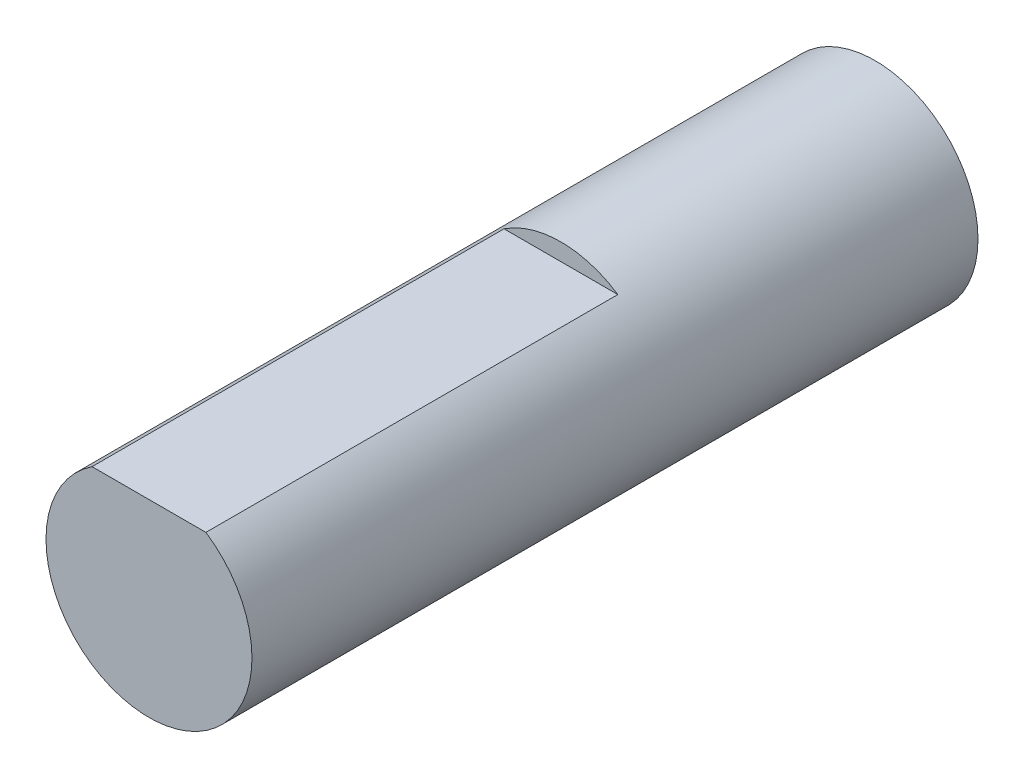
ISO-10303-21;
HEADER;
FILE_DESCRIPTION(('STEP AP214'),'2;1');
FILE_NAME('part.step','',(''),(''),'','','');
FILE_SCHEMA(('AUTOMOTIVE_DESIGN { 1 0 10303 214 1 1 1 1 }'));
ENDSEC;
DATA;
#1=APPLICATION_CONTEXT('core data for automotive mechanical design processes');
#2=APPLICATION_PROTOCOL_DEFINITION('international standard','automotive_design',2000,#1);
#3=PRODUCT_CONTEXT('',#1,'mechanical');
#4=PRODUCT('Part','Part','',(#3));
#5=PRODUCT_RELATED_PRODUCT_CATEGORY('part','',(#4));
#6=PRODUCT_DEFINITION_FORMATION('','',#4);
#7=PRODUCT_DEFINITION_CONTEXT('part definition',#1,'design');
#8=PRODUCT_DEFINITION('design','',#6,#7);
#9=PRODUCT_DEFINITION_SHAPE('','',#8);
#10=(LENGTH_UNIT() NAMED_UNIT(*) SI_UNIT(.MILLI.,.METRE.));
#11=(NAMED_UNIT(*) PLANE_ANGLE_UNIT() SI_UNIT($,.RADIAN.));
#12=(NAMED_UNIT(*) SI_UNIT($,.STERADIAN.) SOLID_ANGLE_UNIT());
#13=UNCERTAINTY_MEASURE_WITH_UNIT(LENGTH_MEASURE(1.E-05),#10,'distance_accuracy_value','');
#14=(GEOMETRIC_REPRESENTATION_CONTEXT(3) GLOBAL_UNCERTAINTY_ASSIGNED_CONTEXT((#13)) GLOBAL_UNIT_ASSIGNED_CONTEXT((#10,
#11,#12)) REPRESENTATION_CONTEXT('',''));
#15=CARTESIAN_POINT('',(0.,0.,0.));
#16=DIRECTION('',(0.,0.,1.));
#17=DIRECTION('',(1.,0.,0.));
#18=AXIS2_PLACEMENT_3D('',#15,#16,#17);
#19=CARTESIAN_POINT('',(0.,0.,21.15));
#20=DIRECTION('',(0.,0.,-1.));
#21=DIRECTION('',(-1.,0.,0.));
#22=AXIS2_PLACEMENT_3D('',#19,#20,#21);
#23=CYLINDRICAL_SURFACE('',#22,3.);
#24=CARTESIAN_POINT('',(0.,0.,21.15));
#25=DIRECTION('',(0.,0.,1.));
#26=DIRECTION('',(1.,0.,0.));
#27=AXIS2_PLACEMENT_3D('',#24,#25,#26);
#28=CIRCLE('',#27,3.);
#29=CARTESIAN_POINT('',(-1.6583123951777,2.5,21.15));
#30=VERTEX_POINT('',#29);
#31=CARTESIAN_POINT('',(1.6583123951777,2.5,21.15));
#32=VERTEX_POINT('',#31);
#33=EDGE_CURVE('E38',#30,#32,#28,.T.);
#34=ORIENTED_EDGE('',*,*,#33,.F.);
#35=DIRECTION('',(0.,0.,1.));
#36=VECTOR('',#35,1.);
#37=CARTESIAN_POINT('',(-1.6583123951777,2.5,9.15));
#38=LINE('',#37,#36);
#39=CARTESIAN_POINT('',(-1.6583123951777,2.5,9.15));
#40=VERTEX_POINT('',#39);
#41=EDGE_CURVE('E45',#40,#30,#38,.T.);
#42=ORIENTED_EDGE('',*,*,#41,.F.);
#43=CARTESIAN_POINT('',(0.,0.,9.15));
#44=DIRECTION('',(0.,0.,1.));
#45=DIRECTION('',(1.,0.,0.));
#46=AXIS2_PLACEMENT_3D('',#43,#44,#45);
#47=CIRCLE('',#46,3.);
#48=CARTESIAN_POINT('',(1.6583123951777,2.5,9.15));
#49=VERTEX_POINT('',#48);
#50=EDGE_CURVE('E11',#49,#40,#47,.T.);
#51=ORIENTED_EDGE('',*,*,#50,.F.);
#52=DIRECTION('',(0.,0.,1.));
#53=VECTOR('',#52,1.);
#54=CARTESIAN_POINT('',(1.6583123951777,2.5,9.15));
#55=LINE('',#54,#53);
#56=EDGE_CURVE('E57',#49,#32,#55,.T.);
#57=ORIENTED_EDGE('',*,*,#56,.T.);
#58=EDGE_LOOP('',(#34,#42,#51,#57));
#59=FACE_BOUND('',#58,.T.);
#60=CARTESIAN_POINT('',(0.,0.,0.));
#61=DIRECTION('',(0.,0.,1.));
#62=DIRECTION('',(1.,0.,0.));
#63=AXIS2_PLACEMENT_3D('',#60,#61,#62);
#64=CIRCLE('',#63,3.);
#65=CARTESIAN_POINT('',(3.,0.,0.));
#66=VERTEX_POINT('',#65);
#67=EDGE_CURVE('E65',#66,#66,#64,.T.);
#68=ORIENTED_EDGE('',*,*,#67,.T.);
#69=EDGE_LOOP('',(#68));
#70=FACE_BOUND('',#69,.T.);
#71=ADVANCED_FACE('F31',(#59,#70),#23,.T.);
#72=CARTESIAN_POINT('',(0.,0.,21.15));
#73=DIRECTION('',(0.,0.,1.));
#74=DIRECTION('',(1.,0.,0.));
#75=AXIS2_PLACEMENT_3D('',#72,#73,#74);
#76=PLANE('',#75);
#77=DIRECTION('',(1.,0.,0.));
#78=VECTOR('',#77,1.);
#79=CARTESIAN_POINT('',(-1.6583123951777,2.5,21.15));
#80=LINE('',#79,#78);
#81=EDGE_CURVE('E55',#30,#32,#80,.T.);
#82=ORIENTED_EDGE('',*,*,#81,.F.);
#83=ORIENTED_EDGE('',*,*,#33,.T.);
#84=EDGE_LOOP('',(#82,#83));
#85=FACE_BOUND('',#84,.T.);
#86=ADVANCED_FACE('F67',(#85),#76,.T.);
#87=CARTESIAN_POINT('',(0.,0.,0.));
#88=DIRECTION('',(0.,0.,1.));
#89=DIRECTION('',(1.,0.,0.));
#90=AXIS2_PLACEMENT_3D('',#87,#88,#89);
#91=PLANE('',#90);
#92=ORIENTED_EDGE('',*,*,#67,.F.);
#93=EDGE_LOOP('',(#92));
#94=FACE_BOUND('',#93,.T.);
#95=ADVANCED_FACE('F75',(#94),#91,.F.);
#96=CARTESIAN_POINT('',(-1.6583123951777,2.5,9.15));
#97=DIRECTION('',(0.,0.,1.));
#98=DIRECTION('',(1.,0.,0.));
#99=AXIS2_PLACEMENT_3D('',#96,#97,#98);
#100=PLANE('',#99);
#101=DIRECTION('',(1.,0.,0.));
#102=VECTOR('',#101,1.);
#103=CARTESIAN_POINT('',(-1.6583123951777,2.5,9.15));
#104=LINE('',#103,#102);
#105=EDGE_CURVE('E62',#40,#49,#104,.T.);
#106=ORIENTED_EDGE('',*,*,#105,.T.);
#107=ORIENTED_EDGE('',*,*,#50,.T.);
#108=EDGE_LOOP('',(#106,#107));
#109=FACE_BOUND('',#108,.T.);
#110=ADVANCED_FACE('F73',(#109),#100,.T.);
#111=CARTESIAN_POINT('',(-1.6583123951777,2.5,9.15));
#112=DIRECTION('',(0.,-1.,0.));
#113=DIRECTION('',(0.,0.,-1.));
#114=AXIS2_PLACEMENT_3D('',#111,#112,#113);
#115=PLANE('',#114);
#116=ORIENTED_EDGE('',*,*,#81,.T.);
#117=ORIENTED_EDGE('',*,*,#56,.F.);
#118=ORIENTED_EDGE('',*,*,#105,.F.);
#119=ORIENTED_EDGE('',*,*,#41,.T.);
#120=EDGE_LOOP('',(#116,#117,#118,#119));
#121=FACE_BOUND('',#120,.T.);
#122=ADVANCED_FACE('F56',(#121),#115,.F.);
#123=CLOSED_SHELL('',(#71,#86,#95,#110,#122));
#124=MANIFOLD_SOLID_BREP('B2',#123);
#125=ADVANCED_BREP_SHAPE_REPRESENTATION('',(#18,#124),#14);
#126=SHAPE_DEFINITION_REPRESENTATION(#9,#125);
ENDSEC;
END-ISO-10303-21;
